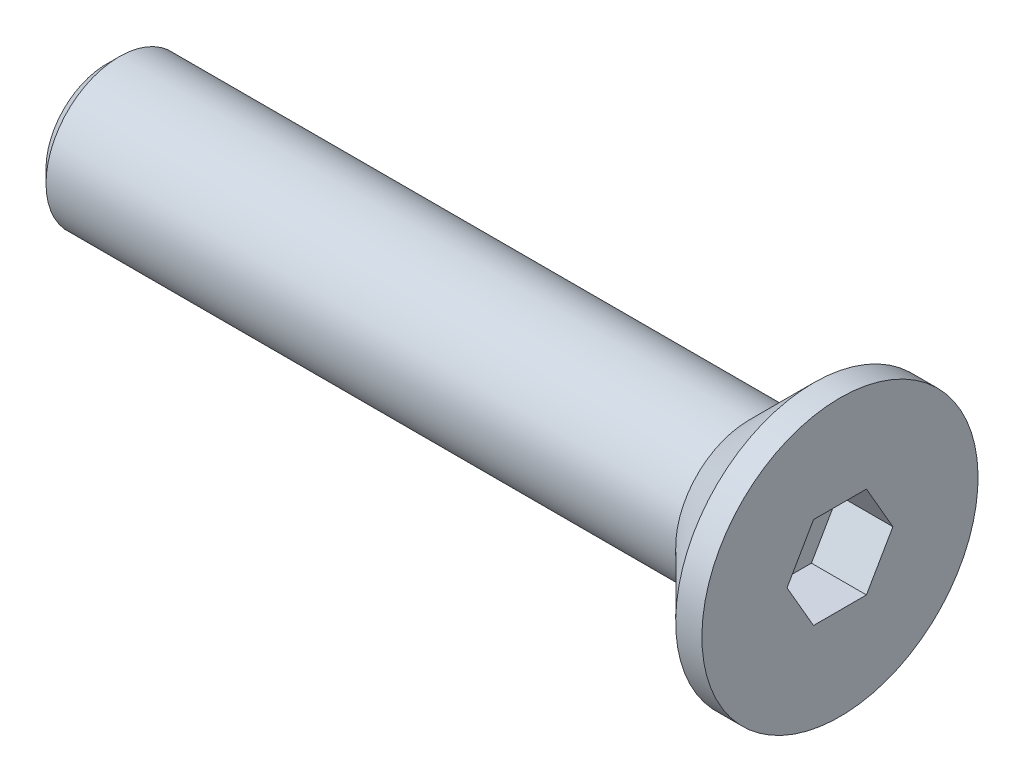
ISO-10303-21;
HEADER;
FILE_DESCRIPTION(('STEP AP214'),'2;1');
FILE_NAME('part.step','',(''),(''),'','','');
FILE_SCHEMA(('AUTOMOTIVE_DESIGN { 1 0 10303 214 1 1 1 1 }'));
ENDSEC;
DATA;
#1=APPLICATION_CONTEXT('core data for automotive mechanical design processes');
#2=APPLICATION_PROTOCOL_DEFINITION('international standard','automotive_design',2000,#1);
#3=PRODUCT_CONTEXT('',#1,'mechanical');
#4=PRODUCT('Part','Part','',(#3));
#5=PRODUCT_RELATED_PRODUCT_CATEGORY('part','',(#4));
#6=PRODUCT_DEFINITION_FORMATION('','',#4);
#7=PRODUCT_DEFINITION_CONTEXT('part definition',#1,'design');
#8=PRODUCT_DEFINITION('design','',#6,#7);
#9=PRODUCT_DEFINITION_SHAPE('','',#8);
#10=(LENGTH_UNIT() NAMED_UNIT(*) SI_UNIT(.MILLI.,.METRE.));
#11=(NAMED_UNIT(*) PLANE_ANGLE_UNIT() SI_UNIT($,.RADIAN.));
#12=(NAMED_UNIT(*) SI_UNIT($,.STERADIAN.) SOLID_ANGLE_UNIT());
#13=UNCERTAINTY_MEASURE_WITH_UNIT(LENGTH_MEASURE(1.E-05),#10,'distance_accuracy_value','');
#14=(GEOMETRIC_REPRESENTATION_CONTEXT(3) GLOBAL_UNCERTAINTY_ASSIGNED_CONTEXT((#13)) GLOBAL_UNIT_ASSIGNED_CONTEXT((#10,
#11,#12)) REPRESENTATION_CONTEXT('',''));
#15=CARTESIAN_POINT('',(0.,0.,0.));
#16=DIRECTION('',(0.,0.,1.));
#17=DIRECTION('',(1.,0.,0.));
#18=AXIS2_PLACEMENT_3D('',#15,#16,#17);
#19=CARTESIAN_POINT('',(0.,0.,0.));
#20=DIRECTION('',(1.,0.,0.));
#21=DIRECTION('',(0.,1.,0.));
#22=AXIS2_PLACEMENT_3D('',#19,#20,#21);
#23=PLANE('',#22);
#24=DIRECTION('',(0.,0.866025403784439,-0.5));
#25=VECTOR('',#24,1.);
#26=CARTESIAN_POINT('',(0.,-1.25,-0.721687836487034));
#27=LINE('',#26,#25);
#28=CARTESIAN_POINT('',(0.,-1.25,-0.721687836487034));
#29=VERTEX_POINT('',#28);
#30=CARTESIAN_POINT('',(0.,0.,-1.44337567297406));
#31=VERTEX_POINT('',#30);
#32=EDGE_CURVE('E31',#29,#31,#27,.T.);
#33=ORIENTED_EDGE('',*,*,#32,.F.);
#34=DIRECTION('',(0.,0.,-1.));
#35=VECTOR('',#34,1.);
#36=CARTESIAN_POINT('',(0.,-1.25,0.721687836487033));
#37=LINE('',#36,#35);
#38=CARTESIAN_POINT('',(0.,-1.25,0.721687836487033));
#39=VERTEX_POINT('',#38);
#40=EDGE_CURVE('E114',#39,#29,#37,.T.);
#41=ORIENTED_EDGE('',*,*,#40,.F.);
#42=DIRECTION('',(0.,-0.866025403784439,-0.5));
#43=VECTOR('',#42,1.);
#44=CARTESIAN_POINT('',(0.,0.,1.44337567297406));
#45=LINE('',#44,#43);
#46=CARTESIAN_POINT('',(0.,0.,1.44337567297406));
#47=VERTEX_POINT('',#46);
#48=EDGE_CURVE('E112',#47,#39,#45,.T.);
#49=ORIENTED_EDGE('',*,*,#48,.F.);
#50=DIRECTION('',(0.,-0.866025403784439,0.5));
#51=VECTOR('',#50,1.);
#52=CARTESIAN_POINT('',(0.,1.25,0.721687836487032));
#53=LINE('',#52,#51);
#54=CARTESIAN_POINT('',(0.,1.25,0.721687836487032));
#55=VERTEX_POINT('',#54);
#56=EDGE_CURVE('E79',#55,#47,#53,.T.);
#57=ORIENTED_EDGE('',*,*,#56,.F.);
#58=DIRECTION('',(0.,0.,1.));
#59=VECTOR('',#58,1.);
#60=CARTESIAN_POINT('',(0.,1.25,-0.721687836487032));
#61=LINE('',#60,#59);
#62=CARTESIAN_POINT('',(0.,1.25,-0.721687836487032));
#63=VERTEX_POINT('',#62);
#64=EDGE_CURVE('E108',#63,#55,#61,.T.);
#65=ORIENTED_EDGE('',*,*,#64,.F.);
#66=DIRECTION('',(0.,0.866025403784439,0.5));
#67=VECTOR('',#66,1.);
#68=CARTESIAN_POINT('',(0.,0.,-1.44337567297406));
#69=LINE('',#68,#67);
#70=EDGE_CURVE('E105',#31,#63,#69,.T.);
#71=ORIENTED_EDGE('',*,*,#70,.F.);
#72=EDGE_LOOP('',(#33,#41,#49,#57,#65,#71));
#73=FACE_BOUND('',#72,.T.);
#74=CARTESIAN_POINT('',(0.,0.,0.));
#75=DIRECTION('',(1.,0.,0.));
#76=DIRECTION('',(0.,1.,0.));
#77=AXIS2_PLACEMENT_3D('',#74,#75,#76);
#78=CIRCLE('',#77,3.765);
#79=CARTESIAN_POINT('',(0.,3.765,0.));
#80=VERTEX_POINT('',#79);
#81=EDGE_CURVE('E129',#80,#80,#78,.T.);
#82=ORIENTED_EDGE('',*,*,#81,.T.);
#83=EDGE_LOOP('',(#82));
#84=FACE_BOUND('',#83,.T.);
#85=ADVANCED_FACE('F16',(#73,#84),#23,.T.);
#86=CARTESIAN_POINT('',(0.,0.,0.));
#87=DIRECTION('',(1.,0.,0.));
#88=DIRECTION('',(0.,1.,0.));
#89=AXIS2_PLACEMENT_3D('',#86,#87,#88);
#90=CYLINDRICAL_SURFACE('',#89,3.765);
#91=CARTESIAN_POINT('',(-0.715,0.,0.));
#92=DIRECTION('',(1.,0.,0.));
#93=DIRECTION('',(0.,1.,0.));
#94=AXIS2_PLACEMENT_3D('',#91,#92,#93);
#95=CIRCLE('',#94,3.765);
#96=CARTESIAN_POINT('',(-0.715000000000001,3.765,0.));
#97=VERTEX_POINT('',#96);
#98=EDGE_CURVE('E126',#97,#97,#95,.T.);
#99=ORIENTED_EDGE('',*,*,#98,.T.);
#100=EDGE_LOOP('',(#99));
#101=FACE_BOUND('',#100,.T.);
#102=ORIENTED_EDGE('',*,*,#81,.F.);
#103=EDGE_LOOP('',(#102));
#104=FACE_BOUND('',#103,.T.);
#105=ADVANCED_FACE('F148',(#101,#104),#90,.T.);
#106=CARTESIAN_POINT('',(-0.715,0.,0.));
#107=DIRECTION('',(1.,0.,0.));
#108=DIRECTION('',(0.,1.,0.));
#109=AXIS2_PLACEMENT_3D('',#106,#107,#108);
#110=CONICAL_SURFACE('',#109,3.765,0.78539816339745);
#111=CARTESIAN_POINT('',(-2.48,0.,0.));
#112=DIRECTION('',(1.,0.,0.));
#113=DIRECTION('',(0.,1.,0.));
#114=AXIS2_PLACEMENT_3D('',#111,#112,#113);
#115=CIRCLE('',#114,2.);
#116=CARTESIAN_POINT('',(-2.48,2.,0.));
#117=VERTEX_POINT('',#116);
#118=EDGE_CURVE('E118',#117,#117,#115,.T.);
#119=ORIENTED_EDGE('',*,*,#118,.T.);
#120=EDGE_LOOP('',(#119));
#121=FACE_BOUND('',#120,.T.);
#122=ORIENTED_EDGE('',*,*,#98,.F.);
#123=EDGE_LOOP('',(#122));
#124=FACE_BOUND('',#123,.T.);
#125=ADVANCED_FACE('F154',(#121,#124),#110,.T.);
#126=CARTESIAN_POINT('',(0.,0.,0.));
#127=DIRECTION('',(1.,0.,0.));
#128=DIRECTION('',(0.,1.,0.));
#129=AXIS2_PLACEMENT_3D('',#126,#127,#128);
#130=CYLINDRICAL_SURFACE('',#129,2.);
#131=CARTESIAN_POINT('',(-19.65,0.,0.));
#132=DIRECTION('',(-1.,0.,0.));
#133=DIRECTION('',(0.,-1.,0.));
#134=AXIS2_PLACEMENT_3D('',#131,#132,#133);
#135=CIRCLE('',#134,2.);
#136=CARTESIAN_POINT('',(-19.65,-2.,0.));
#137=VERTEX_POINT('',#136);
#138=EDGE_CURVE('E24',#137,#137,#135,.F.);
#139=ORIENTED_EDGE('',*,*,#138,.T.);
#140=EDGE_LOOP('',(#139));
#141=FACE_BOUND('',#140,.T.);
#142=ORIENTED_EDGE('',*,*,#118,.F.);
#143=EDGE_LOOP('',(#142));
#144=FACE_BOUND('',#143,.T.);
#145=ADVANCED_FACE('F134',(#141,#144),#130,.T.);
#146=CARTESIAN_POINT('',(-20.,2.,0.));
#147=DIRECTION('',(-1.,0.,0.));
#148=DIRECTION('',(0.,-1.,0.));
#149=AXIS2_PLACEMENT_3D('',#146,#147,#148);
#150=PLANE('',#149);
#151=CARTESIAN_POINT('',(-20.,0.,0.));
#152=DIRECTION('',(-1.,0.,0.));
#153=DIRECTION('',(0.,-1.,0.));
#154=AXIS2_PLACEMENT_3D('',#151,#152,#153);
#155=CIRCLE('',#154,1.65);
#156=CARTESIAN_POINT('',(-20.,-1.65,0.));
#157=VERTEX_POINT('',#156);
#158=EDGE_CURVE('E10',#157,#157,#155,.T.);
#159=ORIENTED_EDGE('',*,*,#158,.T.);
#160=EDGE_LOOP('',(#159));
#161=FACE_BOUND('',#160,.T.);
#162=ADVANCED_FACE('F164',(#161),#150,.T.);
#163=CARTESIAN_POINT('',(-1.5,-1.25,-0.721687836487034));
#164=DIRECTION('',(0.,-0.5,-0.866025403784439));
#165=DIRECTION('',(0.,0.866025403784439,-0.5));
#166=AXIS2_PLACEMENT_3D('',#163,#164,#165);
#167=PLANE('',#166);
#168=ORIENTED_EDGE('',*,*,#32,.T.);
#169=DIRECTION('',(1.,0.,0.));
#170=VECTOR('',#169,1.);
#171=CARTESIAN_POINT('',(-1.5,0.,-1.44337567297406));
#172=LINE('',#171,#170);
#173=CARTESIAN_POINT('',(-1.5,0.,-1.44337567297406));
#174=VERTEX_POINT('',#173);
#175=EDGE_CURVE('E61',#174,#31,#172,.T.);
#176=ORIENTED_EDGE('',*,*,#175,.F.);
#177=DIRECTION('',(0.,0.866025403784439,-0.5));
#178=VECTOR('',#177,1.);
#179=CARTESIAN_POINT('',(-1.5,-1.25,-0.721687836487034));
#180=LINE('',#179,#178);
#181=CARTESIAN_POINT('',(-1.5,-1.25,-0.721687836487034));
#182=VERTEX_POINT('',#181);
#183=EDGE_CURVE('E116',#182,#174,#180,.T.);
#184=ORIENTED_EDGE('',*,*,#183,.F.);
#185=DIRECTION('',(1.,0.,0.));
#186=VECTOR('',#185,1.);
#187=CARTESIAN_POINT('',(-1.5,-1.25,-0.721687836487034));
#188=LINE('',#187,#186);
#189=EDGE_CURVE('E39',#182,#29,#188,.T.);
#190=ORIENTED_EDGE('',*,*,#189,.T.);
#191=EDGE_LOOP('',(#168,#176,#184,#190));
#192=FACE_BOUND('',#191,.T.);
#193=ADVANCED_FACE('F167',(#192),#167,.F.);
#194=CARTESIAN_POINT('',(-1.5,-1.25,0.721687836487033));
#195=DIRECTION('',(0.,-1.,0.));
#196=DIRECTION('',(1.,0.,0.));
#197=AXIS2_PLACEMENT_3D('',#194,#195,#196);
#198=PLANE('',#197);
#199=ORIENTED_EDGE('',*,*,#40,.T.);
#200=ORIENTED_EDGE('',*,*,#189,.F.);
#201=DIRECTION('',(0.,0.,-1.));
#202=VECTOR('',#201,1.);
#203=CARTESIAN_POINT('',(-1.5,-1.25,0.721687836487033));
#204=LINE('',#203,#202);
#205=CARTESIAN_POINT('',(-1.5,-1.25,0.721687836487033));
#206=VERTEX_POINT('',#205);
#207=EDGE_CURVE('E91',#206,#182,#204,.T.);
#208=ORIENTED_EDGE('',*,*,#207,.F.);
#209=DIRECTION('',(1.,0.,0.));
#210=VECTOR('',#209,1.);
#211=CARTESIAN_POINT('',(-1.5,-1.25,0.721687836487033));
#212=LINE('',#211,#210);
#213=EDGE_CURVE('E83',#206,#39,#212,.T.);
#214=ORIENTED_EDGE('',*,*,#213,.T.);
#215=EDGE_LOOP('',(#199,#200,#208,#214));
#216=FACE_BOUND('',#215,.T.);
#217=ADVANCED_FACE('F171',(#216),#198,.F.);
#218=CARTESIAN_POINT('',(-1.5,0.,1.44337567297406));
#219=DIRECTION('',(0.,-0.5,0.866025403784438));
#220=DIRECTION('',(0.,-0.866025403784439,-0.5));
#221=AXIS2_PLACEMENT_3D('',#218,#219,#220);
#222=PLANE('',#221);
#223=ORIENTED_EDGE('',*,*,#48,.T.);
#224=ORIENTED_EDGE('',*,*,#213,.F.);
#225=DIRECTION('',(0.,-0.866025403784439,-0.5));
#226=VECTOR('',#225,1.);
#227=CARTESIAN_POINT('',(-1.5,0.,1.44337567297406));
#228=LINE('',#227,#226);
#229=CARTESIAN_POINT('',(-1.5,0.,1.44337567297406));
#230=VERTEX_POINT('',#229);
#231=EDGE_CURVE('E87',#230,#206,#228,.T.);
#232=ORIENTED_EDGE('',*,*,#231,.F.);
#233=DIRECTION('',(1.,0.,0.));
#234=VECTOR('',#233,1.);
#235=CARTESIAN_POINT('',(-1.5,0.,1.44337567297406));
#236=LINE('',#235,#234);
#237=EDGE_CURVE('E72',#230,#47,#236,.T.);
#238=ORIENTED_EDGE('',*,*,#237,.T.);
#239=EDGE_LOOP('',(#223,#224,#232,#238));
#240=FACE_BOUND('',#239,.T.);
#241=ADVANCED_FACE('F88',(#240),#222,.F.);
#242=CARTESIAN_POINT('',(-1.5,1.25,0.721687836487032));
#243=DIRECTION('',(0.,0.5,0.866025403784438));
#244=DIRECTION('',(0.,-0.866025403784439,0.5));
#245=AXIS2_PLACEMENT_3D('',#242,#243,#244);
#246=PLANE('',#245);
#247=ORIENTED_EDGE('',*,*,#56,.T.);
#248=ORIENTED_EDGE('',*,*,#237,.F.);
#249=DIRECTION('',(0.,-0.866025403784439,0.5));
#250=VECTOR('',#249,1.);
#251=CARTESIAN_POINT('',(-1.5,1.25,0.721687836487032));
#252=LINE('',#251,#250);
#253=CARTESIAN_POINT('',(-1.5,1.25,0.721687836487032));
#254=VERTEX_POINT('',#253);
#255=EDGE_CURVE('E76',#254,#230,#252,.T.);
#256=ORIENTED_EDGE('',*,*,#255,.F.);
#257=DIRECTION('',(1.,0.,0.));
#258=VECTOR('',#257,1.);
#259=CARTESIAN_POINT('',(-1.5,1.25,0.721687836487032));
#260=LINE('',#259,#258);
#261=EDGE_CURVE('E84',#254,#55,#260,.T.);
#262=ORIENTED_EDGE('',*,*,#261,.T.);
#263=EDGE_LOOP('',(#247,#248,#256,#262));
#264=FACE_BOUND('',#263,.T.);
#265=ADVANCED_FACE('F74',(#264),#246,.F.);
#266=CARTESIAN_POINT('',(-1.5,1.25,-0.721687836487032));
#267=DIRECTION('',(0.,1.,0.));
#268=DIRECTION('',(0.,0.,1.));
#269=AXIS2_PLACEMENT_3D('',#266,#267,#268);
#270=PLANE('',#269);
#271=ORIENTED_EDGE('',*,*,#64,.T.);
#272=ORIENTED_EDGE('',*,*,#261,.F.);
#273=DIRECTION('',(0.,0.,1.));
#274=VECTOR('',#273,1.);
#275=CARTESIAN_POINT('',(-1.5,1.25,-0.721687836487032));
#276=LINE('',#275,#274);
#277=CARTESIAN_POINT('',(-1.5,1.25,-0.721687836487032));
#278=VERTEX_POINT('',#277);
#279=EDGE_CURVE('E97',#278,#254,#276,.T.);
#280=ORIENTED_EDGE('',*,*,#279,.F.);
#281=DIRECTION('',(1.,0.,0.));
#282=VECTOR('',#281,1.);
#283=CARTESIAN_POINT('',(-1.5,1.25,-0.721687836487032));
#284=LINE('',#283,#282);
#285=EDGE_CURVE('E121',#278,#63,#284,.T.);
#286=ORIENTED_EDGE('',*,*,#285,.T.);
#287=EDGE_LOOP('',(#271,#272,#280,#286));
#288=FACE_BOUND('',#287,.T.);
#289=ADVANCED_FACE('F174',(#288),#270,.F.);
#290=CARTESIAN_POINT('',(-1.5,0.,-1.44337567297406));
#291=DIRECTION('',(0.,0.5,-0.866025403784439));
#292=DIRECTION('',(0.,0.866025403784439,0.5));
#293=AXIS2_PLACEMENT_3D('',#290,#291,#292);
#294=PLANE('',#293);
#295=ORIENTED_EDGE('',*,*,#70,.T.);
#296=ORIENTED_EDGE('',*,*,#285,.F.);
#297=DIRECTION('',(0.,0.866025403784439,0.5));
#298=VECTOR('',#297,1.);
#299=CARTESIAN_POINT('',(-1.5,0.,-1.44337567297406));
#300=LINE('',#299,#298);
#301=EDGE_CURVE('E99',#174,#278,#300,.T.);
#302=ORIENTED_EDGE('',*,*,#301,.F.);
#303=ORIENTED_EDGE('',*,*,#175,.T.);
#304=EDGE_LOOP('',(#295,#296,#302,#303));
#305=FACE_BOUND('',#304,.T.);
#306=ADVANCED_FACE('F144',(#305),#294,.F.);
#307=CARTESIAN_POINT('',(-1.5,0.,-1.44337567297406));
#308=DIRECTION('',(1.,0.,0.));
#309=DIRECTION('',(0.,1.,0.));
#310=AXIS2_PLACEMENT_3D('',#307,#308,#309);
#311=PLANE('',#310);
#312=ORIENTED_EDGE('',*,*,#183,.T.);
#313=ORIENTED_EDGE('',*,*,#301,.T.);
#314=ORIENTED_EDGE('',*,*,#279,.T.);
#315=ORIENTED_EDGE('',*,*,#255,.T.);
#316=ORIENTED_EDGE('',*,*,#231,.T.);
#317=ORIENTED_EDGE('',*,*,#207,.T.);
#318=EDGE_LOOP('',(#312,#313,#314,#315,#316,#317));
#319=FACE_BOUND('',#318,.T.);
#320=ADVANCED_FACE('F94',(#319),#311,.T.);
#321=CARTESIAN_POINT('',(-19.65,0.,0.));
#322=DIRECTION('',(1.,0.,0.));
#323=DIRECTION('',(0.,1.,0.));
#324=AXIS2_PLACEMENT_3D('',#321,#322,#323);
#325=CONICAL_SURFACE('',#324,2.,0.785398163397448);
#326=ORIENTED_EDGE('',*,*,#158,.F.);
#327=EDGE_LOOP('',(#326));
#328=FACE_BOUND('',#327,.T.);
#329=ORIENTED_EDGE('',*,*,#138,.F.);
#330=EDGE_LOOP('',(#329));
#331=FACE_BOUND('',#330,.T.);
#332=ADVANCED_FACE('F18',(#328,#331),#325,.T.);
#333=CLOSED_SHELL('',(#85,#105,#125,#145,#162,#193,#217,#241,#265,#289,#306,#320,#332));
#334=MANIFOLD_SOLID_BREP('B1',#333);
#335=ADVANCED_BREP_SHAPE_REPRESENTATION('',(#18,#334),#14);
#336=SHAPE_DEFINITION_REPRESENTATION(#9,#335);
ENDSEC;
END-ISO-10303-21;
